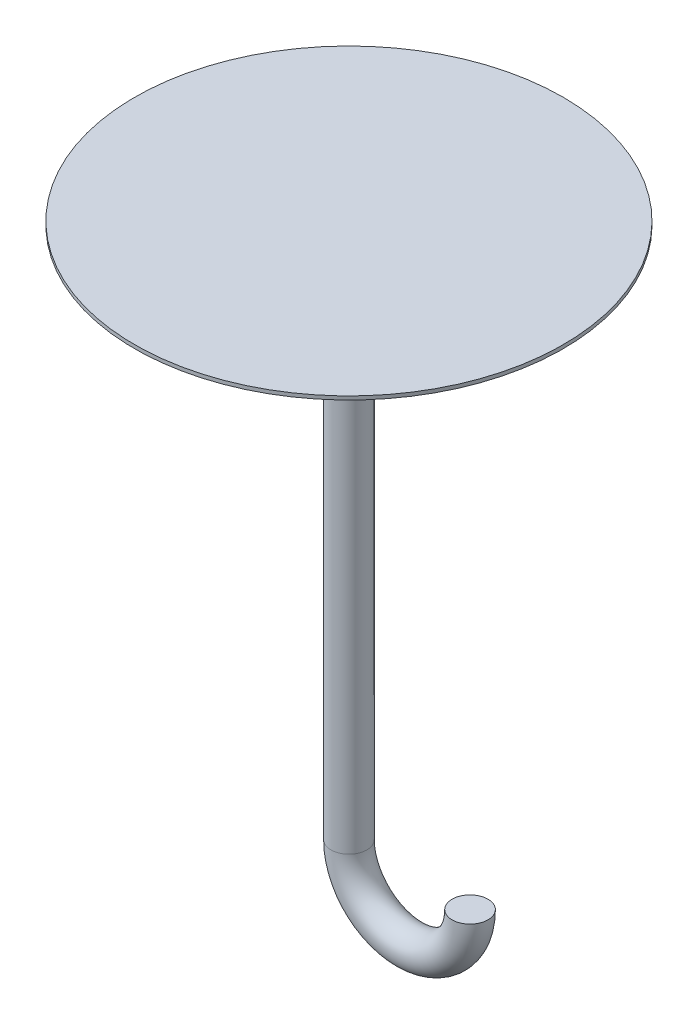
ISO-10303-21;
HEADER;
FILE_DESCRIPTION(('STEP AP214'),'2;1');
FILE_NAME('part.step','',(''),(''),'','','');
FILE_SCHEMA(('AUTOMOTIVE_DESIGN { 1 0 10303 214 1 1 1 1 }'));
ENDSEC;
DATA;
#1=APPLICATION_CONTEXT('core data for automotive mechanical design processes');
#2=APPLICATION_PROTOCOL_DEFINITION('international standard','automotive_design',2000,#1);
#3=PRODUCT_CONTEXT('',#1,'mechanical');
#4=PRODUCT('Part','Part','',(#3));
#5=PRODUCT_RELATED_PRODUCT_CATEGORY('part','',(#4));
#6=PRODUCT_DEFINITION_FORMATION('','',#4);
#7=PRODUCT_DEFINITION_CONTEXT('part definition',#1,'design');
#8=PRODUCT_DEFINITION('design','',#6,#7);
#9=PRODUCT_DEFINITION_SHAPE('','',#8);
#10=(LENGTH_UNIT() NAMED_UNIT(*) SI_UNIT(.MILLI.,.METRE.));
#11=(NAMED_UNIT(*) PLANE_ANGLE_UNIT() SI_UNIT($,.RADIAN.));
#12=(NAMED_UNIT(*) SI_UNIT($,.STERADIAN.) SOLID_ANGLE_UNIT());
#13=UNCERTAINTY_MEASURE_WITH_UNIT(LENGTH_MEASURE(1.E-05),#10,'distance_accuracy_value','');
#14=(GEOMETRIC_REPRESENTATION_CONTEXT(3) GLOBAL_UNCERTAINTY_ASSIGNED_CONTEXT((#13)) GLOBAL_UNIT_ASSIGNED_CONTEXT((#10,
#11,#12)) REPRESENTATION_CONTEXT('',''));
#15=CARTESIAN_POINT('',(0.,0.,0.));
#16=DIRECTION('',(0.,0.,1.));
#17=DIRECTION('',(1.,0.,0.));
#18=AXIS2_PLACEMENT_3D('',#15,#16,#17);
#19=CARTESIAN_POINT('',(28.8881925252888,-81.6263101769353,0.0052120502058179));
#20=DIRECTION('',(0.,1.,0.));
#21=DIRECTION('',(0.,0.,-1.));
#22=AXIS2_PLACEMENT_3D('',#19,#20,#21);
#23=PLANE('',#22);
#24=CARTESIAN_POINT('',(28.8881925252888,-81.6263101769353,0.0052120502058179));
#25=DIRECTION('',(0.,1.,0.));
#26=DIRECTION('',(0.,0.,-1.));
#27=AXIS2_PLACEMENT_3D('',#24,#25,#26);
#28=CIRCLE('',#27,5.01764402087757);
#29=CARTESIAN_POINT('',(33.9058365461664,-81.6263101769353,0.0052120502058179));
#30=VERTEX_POINT('',#29);
#31=EDGE_CURVE('E40',#30,#30,#28,.T.);
#32=ORIENTED_EDGE('',*,*,#31,.T.);
#33=EDGE_LOOP('',(#32));
#34=FACE_BOUND('',#33,.T.);
#35=ADVANCED_FACE('F33',(#34),#23,.T.);
#36=CARTESIAN_POINT('',(-5.01764131388255,68.3736898230647,0.0052120502058179));
#37=DIRECTION('',(0.,-1.,0.));
#38=DIRECTION('',(0.,0.,-1.));
#39=AXIS2_PLACEMENT_3D('',#36,#37,#38);
#40=CYLINDRICAL_SURFACE('',#39,5.01764402087757);
#41=CARTESIAN_POINT('',(-5.01764131388255,67.3736898230647,0.0052120502058179));
#42=DIRECTION('',(0.,-1.,0.));
#43=DIRECTION('',(0.,0.,-1.));
#44=AXIS2_PLACEMENT_3D('',#41,#42,#43);
#45=CIRCLE('',#44,5.01764402087757);
#46=CARTESIAN_POINT('',(-5.01764131388255,67.3736898230647,-5.01243197067175));
#47=VERTEX_POINT('',#46);
#48=EDGE_CURVE('E10',#47,#47,#45,.F.);
#49=ORIENTED_EDGE('',*,*,#48,.F.);
#50=EDGE_LOOP('',(#49));
#51=FACE_BOUND('',#50,.T.);
#52=CARTESIAN_POINT('',(-5.01764131388255,-81.6263101769353,0.0052120502058179));
#53=DIRECTION('',(0.,-1.,0.));
#54=DIRECTION('',(0.,0.,-1.));
#55=AXIS2_PLACEMENT_3D('',#52,#53,#54);
#56=CIRCLE('',#55,5.01764402087757);
#57=CARTESIAN_POINT('',(-10.0352853347601,-81.6263101769353,0.0052120502058179));
#58=VERTEX_POINT('',#57);
#59=EDGE_CURVE('E44',#58,#58,#56,.T.);
#60=ORIENTED_EDGE('',*,*,#59,.F.);
#61=EDGE_LOOP('',(#60));
#62=FACE_BOUND('',#61,.T.);
#63=ADVANCED_FACE('F72',(#51,#62),#40,.T.);
#64=CARTESIAN_POINT('',(11.9352756057031,-81.6263101769353,0.0052120502058179));
#65=DIRECTION('',(0.,0.,1.));
#66=DIRECTION('',(1.,0.,0.));
#67=AXIS2_PLACEMENT_3D('',#64,#65,#66);
#68=TOROIDAL_SURFACE('',#67,16.9529169195857,5.01764402087757);
#69=CARTESIAN_POINT('',(11.9352756057031,-81.6263101769353,0.0052120502058179));
#70=DIRECTION('',(0.,0.,1.));
#71=DIRECTION('',(1.,0.,0.));
#72=AXIS2_PLACEMENT_3D('',#69,#70,#71);
#73=CIRCLE('',#72,21.9705609404633);
#74=EDGE_CURVE('',#58,#30,#73,.T.);
#75=ORIENTED_EDGE('',*,*,#59,.T.);
#76=ORIENTED_EDGE('',*,*,#31,.F.);
#77=ORIENTED_EDGE('',*,*,#74,.T.);
#78=ORIENTED_EDGE('',*,*,#74,.F.);
#79=EDGE_LOOP('',(#75,#77,#76,#78));
#80=FACE_BOUND('',#79,.T.);
#81=ADVANCED_FACE('F62',(#80),#68,.T.);
#82=CARTESIAN_POINT('',(-5.01764131388255,67.3736898230647,0.0052120502058179));
#83=DIRECTION('',(0.,1.,0.));
#84=DIRECTION('',(0.,0.,1.));
#85=AXIS2_PLACEMENT_3D('',#82,#83,#84);
#86=CYLINDRICAL_SURFACE('',#85,60.);
#87=CARTESIAN_POINT('',(-5.01764131388255,67.3736898230647,0.0052120502058179));
#88=DIRECTION('',(0.,-1.,0.));
#89=DIRECTION('',(0.,0.,-1.));
#90=AXIS2_PLACEMENT_3D('',#87,#88,#89);
#91=CIRCLE('',#90,60.);
#92=CARTESIAN_POINT('',(-5.01764131388255,67.3736898230647,-59.9947879497942));
#93=VERTEX_POINT('',#92);
#94=EDGE_CURVE('E48',#93,#93,#91,.T.);
#95=ORIENTED_EDGE('',*,*,#94,.F.);
#96=EDGE_LOOP('',(#95));
#97=FACE_BOUND('',#96,.T.);
#98=CARTESIAN_POINT('',(-5.01764131388255,68.3736898230647,0.0052120502058179));
#99=DIRECTION('',(0.,-1.,0.));
#100=DIRECTION('',(0.,0.,-1.));
#101=AXIS2_PLACEMENT_3D('',#98,#99,#100);
#102=CIRCLE('',#101,60.);
#103=CARTESIAN_POINT('',(-5.01764131388255,68.3736898230647,-59.9947879497942));
#104=VERTEX_POINT('',#103);
#105=EDGE_CURVE('E51',#104,#104,#102,.T.);
#106=ORIENTED_EDGE('',*,*,#105,.T.);
#107=EDGE_LOOP('',(#106));
#108=FACE_BOUND('',#107,.T.);
#109=ADVANCED_FACE('F59',(#97,#108),#86,.T.);
#110=CARTESIAN_POINT('',(-5.01764131388255,67.3736898230647,0.0052120502058179));
#111=DIRECTION('',(0.,-1.,0.));
#112=DIRECTION('',(0.,0.,-1.));
#113=AXIS2_PLACEMENT_3D('',#110,#111,#112);
#114=PLANE('',#113);
#115=ORIENTED_EDGE('',*,*,#48,.T.);
#116=EDGE_LOOP('',(#115));
#117=FACE_BOUND('',#116,.T.);
#118=ORIENTED_EDGE('',*,*,#94,.T.);
#119=EDGE_LOOP('',(#118));
#120=FACE_BOUND('',#119,.T.);
#121=ADVANCED_FACE('F57',(#117,#120),#114,.T.);
#122=CARTESIAN_POINT('',(-5.01764131388255,68.3736898230647,0.0052120502058179));
#123=DIRECTION('',(0.,-1.,0.));
#124=DIRECTION('',(0.,0.,-1.));
#125=AXIS2_PLACEMENT_3D('',#122,#123,#124);
#126=PLANE('',#125);
#127=ORIENTED_EDGE('',*,*,#105,.F.);
#128=EDGE_LOOP('',(#127));
#129=FACE_BOUND('',#128,.T.);
#130=ADVANCED_FACE('F35',(#129),#126,.F.);
#131=CLOSED_SHELL('',(#35,#63,#81,#109,#121,#130));
#132=MANIFOLD_SOLID_BREP('B2',#131);
#133=ADVANCED_BREP_SHAPE_REPRESENTATION('',(#18,#132),#14);
#134=SHAPE_DEFINITION_REPRESENTATION(#9,#133);
ENDSEC;
END-ISO-10303-21;
